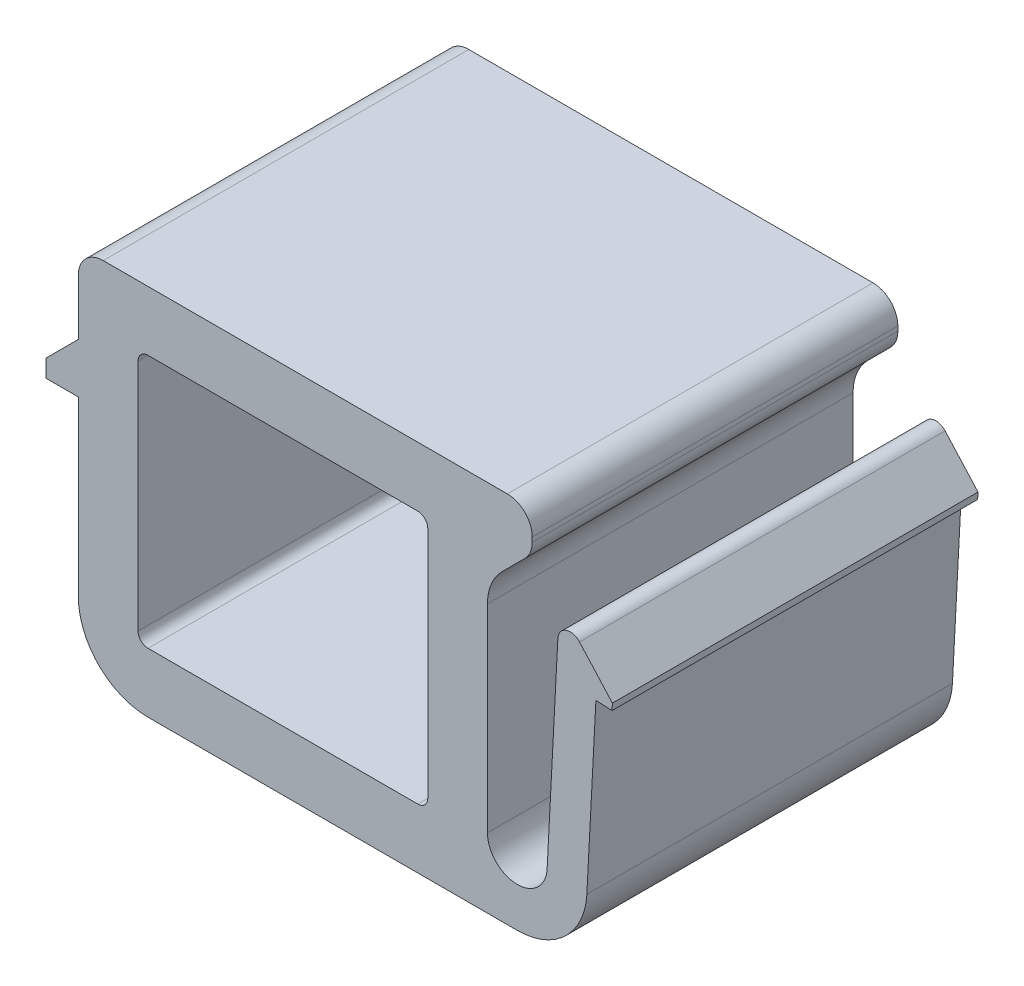
ISO-10303-21;
HEADER;
FILE_DESCRIPTION(('STEP AP214'),'2;1');
FILE_NAME('part.step','',(''),(''),'','','');
FILE_SCHEMA(('AUTOMOTIVE_DESIGN { 1 0 10303 214 1 1 1 1 }'));
ENDSEC;
DATA;
#1=APPLICATION_CONTEXT('core data for automotive mechanical design processes');
#2=APPLICATION_PROTOCOL_DEFINITION('international standard','automotive_design',2000,#1);
#3=PRODUCT_CONTEXT('',#1,'mechanical');
#4=PRODUCT('Part','Part','',(#3));
#5=PRODUCT_RELATED_PRODUCT_CATEGORY('part','',(#4));
#6=PRODUCT_DEFINITION_FORMATION('','',#4);
#7=PRODUCT_DEFINITION_CONTEXT('part definition',#1,'design');
#8=PRODUCT_DEFINITION('design','',#6,#7);
#9=PRODUCT_DEFINITION_SHAPE('','',#8);
#10=(LENGTH_UNIT() NAMED_UNIT(*) SI_UNIT(.MILLI.,.METRE.));
#11=(NAMED_UNIT(*) PLANE_ANGLE_UNIT() SI_UNIT($,.RADIAN.));
#12=(NAMED_UNIT(*) SI_UNIT($,.STERADIAN.) SOLID_ANGLE_UNIT());
#13=UNCERTAINTY_MEASURE_WITH_UNIT(LENGTH_MEASURE(1.E-05),#10,'distance_accuracy_value','');
#14=(GEOMETRIC_REPRESENTATION_CONTEXT(3) GLOBAL_UNCERTAINTY_ASSIGNED_CONTEXT((#13)) GLOBAL_UNIT_ASSIGNED_CONTEXT((#10,
#11,#12)) REPRESENTATION_CONTEXT('',''));
#15=CARTESIAN_POINT('',(0.,0.,0.));
#16=DIRECTION('',(0.,0.,1.));
#17=DIRECTION('',(1.,0.,0.));
#18=AXIS2_PLACEMENT_3D('',#15,#16,#17);
#19=CARTESIAN_POINT('',(180.349494064628,355.600068402604,-115.321000953769));
#20=DIRECTION('',(0.707106781186545,-0.70710678118655,0.));
#21=DIRECTION('',(0.70710678118655,0.707106781186545,0.));
#22=AXIS2_PLACEMENT_3D('',#19,#20,#21);
#23=PLANE('',#22);
#24=DIRECTION('',(0.,0.,1.));
#25=VECTOR('',#24,1.);
#26=CARTESIAN_POINT('',(181.856600845815,357.107175183791,-115.321000953769));
#27=LINE('',#26,#25);
#28=CARTESIAN_POINT('',(181.856600845815,357.107175183791,-100.621000953769));
#29=VERTEX_POINT('',#28);
#30=CARTESIAN_POINT('',(181.856600845815,357.107175183791,-115.321000953769));
#31=VERTEX_POINT('',#30);
#32=EDGE_CURVE('E191',#29,#31,#27,.F.);
#33=ORIENTED_EDGE('',*,*,#32,.F.);
#34=DIRECTION('',(0.70710678118655,0.707106781186545,0.));
#35=VECTOR('',#34,1.);
#36=CARTESIAN_POINT('',(180.349494064628,355.600068402604,-100.621000953769));
#37=LINE('',#36,#35);
#38=CARTESIAN_POINT('',(180.935280502256,356.185854840232,-100.621000953769));
#39=VERTEX_POINT('',#38);
#40=EDGE_CURVE('E187',#29,#39,#37,.F.);
#41=ORIENTED_EDGE('',*,*,#40,.T.);
#42=DIRECTION('',(0.,0.,1.));
#43=VECTOR('',#42,1.);
#44=CARTESIAN_POINT('',(180.935280502256,356.185854840232,-115.421000953769));
#45=LINE('',#44,#43);
#46=CARTESIAN_POINT('',(180.935280502256,356.185854840232,-115.321000953769));
#47=VERTEX_POINT('',#46);
#48=EDGE_CURVE('E367',#39,#47,#45,.F.);
#49=ORIENTED_EDGE('',*,*,#48,.T.);
#50=DIRECTION('',(0.70710678118655,0.707106781186545,0.));
#51=VECTOR('',#50,1.);
#52=CARTESIAN_POINT('',(180.349494064628,355.600068402604,-115.321000953769));
#53=LINE('',#52,#51);
#54=EDGE_CURVE('E372',#47,#31,#53,.T.);
#55=ORIENTED_EDGE('',*,*,#54,.T.);
#56=EDGE_LOOP('',(#33,#41,#49,#55));
#57=FACE_BOUND('',#56,.T.);
#58=ADVANCED_FACE('F17',(#57),#23,.T.);
#59=CARTESIAN_POINT('',(181.149494064629,357.814281964978,-115.321000953769));
#60=DIRECTION('',(0.,0.,1.));
#61=DIRECTION('',(0.,-1.,0.));
#62=AXIS2_PLACEMENT_3D('',#59,#60,#61);
#63=CYLINDRICAL_SURFACE('',#62,1.);
#64=CARTESIAN_POINT('',(181.149494064629,357.814281964978,-115.321000953769));
#65=DIRECTION('',(0.,0.,1.));
#66=DIRECTION('',(0.,-1.,0.));
#67=AXIS2_PLACEMENT_3D('',#64,#65,#66);
#68=CIRCLE('',#67,1.);
#69=CARTESIAN_POINT('',(182.149494064629,357.814281964978,-115.321000953769));
#70=VERTEX_POINT('',#69);
#71=EDGE_CURVE('E196',#31,#70,#68,.T.);
#72=ORIENTED_EDGE('',*,*,#71,.T.);
#73=DIRECTION('',(0.,0.,1.));
#74=VECTOR('',#73,1.);
#75=CARTESIAN_POINT('',(182.149494064629,357.814281964978,-115.321000953769));
#76=LINE('',#75,#74);
#77=CARTESIAN_POINT('',(182.149494064629,357.814281964978,-100.621000953769));
#78=VERTEX_POINT('',#77);
#79=EDGE_CURVE('E193',#78,#70,#76,.F.);
#80=ORIENTED_EDGE('',*,*,#79,.F.);
#81=CARTESIAN_POINT('',(181.149494064629,357.814281964978,-100.621000953769));
#82=DIRECTION('',(0.,0.,1.));
#83=DIRECTION('',(0.,-1.,0.));
#84=AXIS2_PLACEMENT_3D('',#81,#82,#83);
#85=CIRCLE('',#84,1.);
#86=EDGE_CURVE('E20',#78,#29,#85,.F.);
#87=ORIENTED_EDGE('',*,*,#86,.T.);
#88=ORIENTED_EDGE('',*,*,#32,.T.);
#89=EDGE_LOOP('',(#72,#80,#87,#88));
#90=FACE_BOUND('',#89,.T.);
#91=ADVANCED_FACE('F194',(#90),#63,.T.);
#92=CARTESIAN_POINT('',(162.599494064628,355.185854578278,-115.521000953769));
#93=DIRECTION('',(-1.,0.,0.));
#94=DIRECTION('',(0.,-1.,0.));
#95=AXIS2_PLACEMENT_3D('',#92,#93,#94);
#96=PLANE('',#95);
#97=DIRECTION('',(0.,-1.,0.));
#98=VECTOR('',#97,1.);
#99=CARTESIAN_POINT('',(162.599494064628,355.185854578278,-100.621000953769));
#100=LINE('',#99,#98);
#101=CARTESIAN_POINT('',(162.599494064628,353.750068140651,-100.621000953769));
#102=VERTEX_POINT('',#101);
#103=CARTESIAN_POINT('',(162.599494064628,354.454483728379,-100.621000953769));
#104=VERTEX_POINT('',#103);
#105=EDGE_CURVE('E364',#102,#104,#100,.F.);
#106=ORIENTED_EDGE('',*,*,#105,.T.);
#107=DIRECTION('',(0.,0.,1.));
#108=VECTOR('',#107,1.);
#109=CARTESIAN_POINT('',(162.599494064628,354.45448372838,-115.521000953769));
#110=LINE('',#109,#108);
#111=CARTESIAN_POINT('',(162.599494064628,354.45448372838,-115.321000953769));
#112=VERTEX_POINT('',#111);
#113=EDGE_CURVE('E320',#112,#104,#110,.T.);
#114=ORIENTED_EDGE('',*,*,#113,.F.);
#115=DIRECTION('',(0.,-1.,0.));
#116=VECTOR('',#115,1.);
#117=CARTESIAN_POINT('',(162.599494064628,355.185854578278,-115.321000953769));
#118=LINE('',#117,#116);
#119=CARTESIAN_POINT('',(162.599494064628,353.750068140651,-115.321000953769));
#120=VERTEX_POINT('',#119);
#121=EDGE_CURVE('E386',#112,#120,#118,.T.);
#122=ORIENTED_EDGE('',*,*,#121,.T.);
#123=DIRECTION('',(0.,0.,1.));
#124=VECTOR('',#123,1.);
#125=CARTESIAN_POINT('',(162.599494064628,353.750068140651,-115.521000953769));
#126=LINE('',#125,#124);
#127=EDGE_CURVE('E349',#102,#120,#126,.F.);
#128=ORIENTED_EDGE('',*,*,#127,.F.);
#129=EDGE_LOOP('',(#106,#114,#122,#128));
#130=FACE_BOUND('',#129,.T.);
#131=ADVANCED_FACE('F630',(#130),#96,.T.);
#132=CARTESIAN_POINT('',(162.199494064628,353.750068140651,-115.521000953769));
#133=DIRECTION('',(0.,-1.,0.));
#134=DIRECTION('',(1.,0.,0.));
#135=AXIS2_PLACEMENT_3D('',#132,#133,#134);
#136=PLANE('',#135);
#137=DIRECTION('',(1.,0.,0.));
#138=VECTOR('',#137,1.);
#139=CARTESIAN_POINT('',(162.199494064628,353.750068140651,-100.621000953769));
#140=LINE('',#139,#138);
#141=CARTESIAN_POINT('',(163.89949406463,353.750068140651,-100.621000953769));
#142=VERTEX_POINT('',#141);
#143=EDGE_CURVE('E356',#142,#102,#140,.F.);
#144=ORIENTED_EDGE('',*,*,#143,.T.);
#145=ORIENTED_EDGE('',*,*,#127,.T.);
#146=DIRECTION('',(1.,0.,0.));
#147=VECTOR('',#146,1.);
#148=CARTESIAN_POINT('',(162.199494064628,353.750068140651,-115.321000953769));
#149=LINE('',#148,#147);
#150=CARTESIAN_POINT('',(163.89949406463,353.750068140651,-115.321000953769));
#151=VERTEX_POINT('',#150);
#152=EDGE_CURVE('E359',#120,#151,#149,.T.);
#153=ORIENTED_EDGE('',*,*,#152,.T.);
#154=DIRECTION('',(0.,0.,1.));
#155=VECTOR('',#154,1.);
#156=CARTESIAN_POINT('',(163.89949406463,353.750068140651,-115.521000953769));
#157=LINE('',#156,#155);
#158=EDGE_CURVE('E312',#142,#151,#157,.F.);
#159=ORIENTED_EDGE('',*,*,#158,.F.);
#160=EDGE_LOOP('',(#144,#145,#153,#159));
#161=FACE_BOUND('',#160,.T.);
#162=ADVANCED_FACE('F594',(#161),#136,.T.);
#163=CARTESIAN_POINT('',(184.709391644121,353.594002730076,-115.521000953769));
#164=DIRECTION('',(-0.0523359562437548,-0.998629534754531,0.));
#165=DIRECTION('',(0.998629534754531,-0.0523359562437548,0.));
#166=AXIS2_PLACEMENT_3D('',#163,#164,#165);
#167=PLANE('',#166);
#168=DIRECTION('',(0.998629534754531,-0.0523359562437548,0.));
#169=VECTOR('',#168,1.);
#170=CARTESIAN_POINT('',(184.709391644121,353.594002730076,-100.621000953769));
#171=LINE('',#170,#169);
#172=CARTESIAN_POINT('',(185.35850084171,353.559984358517,-100.621000953769));
#173=VERTEX_POINT('',#172);
#174=CARTESIAN_POINT('',(184.709391644121,353.594002730076,-100.621000953769));
#175=VERTEX_POINT('',#174);
#176=EDGE_CURVE('E343',#173,#175,#171,.F.);
#177=ORIENTED_EDGE('',*,*,#176,.T.);
#178=DIRECTION('',(0.,0.,1.));
#179=VECTOR('',#178,1.);
#180=CARTESIAN_POINT('',(184.709391644121,353.594002730076,-115.521000953769));
#181=LINE('',#180,#179);
#182=CARTESIAN_POINT('',(184.709391644121,353.594002730076,-115.321000953769));
#183=VERTEX_POINT('',#182);
#184=EDGE_CURVE('E291',#183,#175,#181,.T.);
#185=ORIENTED_EDGE('',*,*,#184,.F.);
#186=DIRECTION('',(0.998629534754531,-0.0523359562437548,0.));
#187=VECTOR('',#186,1.);
#188=CARTESIAN_POINT('',(184.709391644121,353.594002730076,-115.321000953769));
#189=LINE('',#188,#187);
#190=CARTESIAN_POINT('',(185.35850084171,353.559984358517,-115.321000953769));
#191=VERTEX_POINT('',#190);
#192=EDGE_CURVE('E346',#183,#191,#189,.T.);
#193=ORIENTED_EDGE('',*,*,#192,.T.);
#194=DIRECTION('',(0.,0.,1.));
#195=VECTOR('',#194,1.);
#196=CARTESIAN_POINT('',(185.35850084171,353.559984358517,-115.521000953769));
#197=LINE('',#196,#195);
#198=EDGE_CURVE('E337',#173,#191,#197,.F.);
#199=ORIENTED_EDGE('',*,*,#198,.F.);
#200=EDGE_LOOP('',(#177,#185,#193,#199));
#201=FACE_BOUND('',#200,.T.);
#202=ADVANCED_FACE('F618',(#201),#167,.T.);
#203=CARTESIAN_POINT('',(185.35850084171,353.559984358517,-115.521000953769));
#204=DIRECTION('',(0.99862953475458,-0.0523359562428256,0.));
#205=DIRECTION('',(0.0523359562428256,0.99862953475458,0.));
#206=AXIS2_PLACEMENT_3D('',#203,#204,#205);
#207=PLANE('',#206);
#208=DIRECTION('',(0.0523359562428256,0.99862953475458,0.));
#209=VECTOR('',#208,1.);
#210=CARTESIAN_POINT('',(185.35850084171,353.559984358517,-100.621000953769));
#211=LINE('',#210,#209);
#212=CARTESIAN_POINT('',(185.372484947691,353.826816996197,-100.621000953769));
#213=VERTEX_POINT('',#212);
#214=EDGE_CURVE('E334',#213,#173,#211,.F.);
#215=ORIENTED_EDGE('',*,*,#214,.T.);
#216=ORIENTED_EDGE('',*,*,#198,.T.);
#217=DIRECTION('',(0.0523359562428256,0.99862953475458,0.));
#218=VECTOR('',#217,1.);
#219=CARTESIAN_POINT('',(185.35850084171,353.559984358517,-115.321000953769));
#220=LINE('',#219,#218);
#221=CARTESIAN_POINT('',(185.372484947691,353.826816996197,-115.321000953769));
#222=VERTEX_POINT('',#221);
#223=EDGE_CURVE('E338',#191,#222,#220,.T.);
#224=ORIENTED_EDGE('',*,*,#223,.T.);
#225=DIRECTION('',(0.,0.,1.));
#226=VECTOR('',#225,1.);
#227=CARTESIAN_POINT('',(185.372484947691,353.826816996197,-115.521000953769));
#228=LINE('',#227,#226);
#229=EDGE_CURVE('E287',#213,#222,#228,.F.);
#230=ORIENTED_EDGE('',*,*,#229,.F.);
#231=EDGE_LOOP('',(#215,#216,#224,#230));
#232=FACE_BOUND('',#231,.T.);
#233=ADVANCED_FACE('F459',(#232),#207,.T.);
#234=CARTESIAN_POINT('',(183.67946407574,354.959868889521,-115.421000953769));
#235=DIRECTION('',(0.,0.,1.));
#236=DIRECTION('',(0.,-1.,0.));
#237=AXIS2_PLACEMENT_3D('',#234,#235,#236);
#238=CYLINDRICAL_SURFACE('',#237,0.499999999999997);
#239=CARTESIAN_POINT('',(183.67946407574,354.959868889521,-115.321000953769));
#240=DIRECTION('',(0.,0.,1.));
#241=DIRECTION('',(0.,-1.,0.));
#242=AXIS2_PLACEMENT_3D('',#239,#240,#241);
#243=CIRCLE('',#242,0.499999999999997);
#244=CARTESIAN_POINT('',(184.051036488479,355.2944341927,-115.321000953769));
#245=VERTEX_POINT('',#244);
#246=CARTESIAN_POINT('',(183.180149308363,354.986036867642,-115.321000953769));
#247=VERTEX_POINT('',#246);
#248=EDGE_CURVE('E440',#245,#247,#243,.T.);
#249=ORIENTED_EDGE('',*,*,#248,.T.);
#250=DIRECTION('',(0.,0.,1.));
#251=VECTOR('',#250,1.);
#252=CARTESIAN_POINT('',(183.180149308363,354.986036867642,-115.321000953769));
#253=LINE('',#252,#251);
#254=CARTESIAN_POINT('',(183.180149308363,354.986036867642,-100.621000953769));
#255=VERTEX_POINT('',#254);
#256=EDGE_CURVE('E284',#247,#255,#253,.T.);
#257=ORIENTED_EDGE('',*,*,#256,.T.);
#258=CARTESIAN_POINT('',(183.67946407574,354.959868889521,-100.621000953769));
#259=DIRECTION('',(0.,0.,1.));
#260=DIRECTION('',(0.,-1.,0.));
#261=AXIS2_PLACEMENT_3D('',#258,#259,#260);
#262=CIRCLE('',#261,0.499999999999997);
#263=CARTESIAN_POINT('',(184.051036488479,355.2944341927,-100.621000953769));
#264=VERTEX_POINT('',#263);
#265=EDGE_CURVE('E377',#255,#264,#262,.F.);
#266=ORIENTED_EDGE('',*,*,#265,.T.);
#267=DIRECTION('',(0.,0.,1.));
#268=VECTOR('',#267,1.);
#269=CARTESIAN_POINT('',(184.051036488479,355.2944341927,-115.521000953769));
#270=LINE('',#269,#268);
#271=EDGE_CURVE('E288',#245,#264,#270,.T.);
#272=ORIENTED_EDGE('',*,*,#271,.F.);
#273=EDGE_LOOP('',(#249,#257,#266,#272));
#274=FACE_BOUND('',#273,.T.);
#275=ADVANCED_FACE('F444',(#274),#238,.T.);
#276=CARTESIAN_POINT('',(182.349494064629,354.771641277859,-115.421000953769));
#277=DIRECTION('',(0.,0.,1.));
#278=DIRECTION('',(0.,-1.,0.));
#279=AXIS2_PLACEMENT_3D('',#276,#277,#278);
#280=CYLINDRICAL_SURFACE('',#279,2.);
#281=ORIENTED_EDGE('',*,*,#48,.F.);
#282=CARTESIAN_POINT('',(182.349494064629,354.771641277859,-100.621000953769));
#283=DIRECTION('',(0.,0.,1.));
#284=DIRECTION('',(0.,-1.,0.));
#285=AXIS2_PLACEMENT_3D('',#282,#283,#284);
#286=CIRCLE('',#285,2.);
#287=CARTESIAN_POINT('',(180.349494064628,354.771641277858,-100.621000953769));
#288=VERTEX_POINT('',#287);
#289=EDGE_CURVE('E371',#288,#39,#286,.F.);
#290=ORIENTED_EDGE('',*,*,#289,.F.);
#291=DIRECTION('',(0.,0.,1.));
#292=VECTOR('',#291,1.);
#293=CARTESIAN_POINT('',(180.349494064629,354.771641277858,-115.521000953769));
#294=LINE('',#293,#292);
#295=CARTESIAN_POINT('',(180.349494064628,354.771641277859,-115.321000953769));
#296=VERTEX_POINT('',#295);
#297=EDGE_CURVE('E279',#296,#288,#294,.T.);
#298=ORIENTED_EDGE('',*,*,#297,.F.);
#299=CARTESIAN_POINT('',(182.349494064629,354.771641277859,-115.321000953769));
#300=DIRECTION('',(0.,0.,1.));
#301=DIRECTION('',(0.,-1.,0.));
#302=AXIS2_PLACEMENT_3D('',#299,#300,#301);
#303=CIRCLE('',#302,2.);
#304=EDGE_CURVE('E370',#47,#296,#303,.T.);
#305=ORIENTED_EDGE('',*,*,#304,.F.);
#306=EDGE_LOOP('',(#281,#290,#298,#305));
#307=FACE_BOUND('',#306,.T.);
#308=ADVANCED_FACE('F552',(#307),#280,.F.);
#309=CARTESIAN_POINT('',(177.549494064629,356.200068402603,-115.321000953769));
#310=DIRECTION('',(0.,0.,1.));
#311=DIRECTION('',(0.,-1.,0.));
#312=AXIS2_PLACEMENT_3D('',#309,#310,#311);
#313=CYLINDRICAL_SURFACE('',#312,0.4);
#314=DIRECTION('',(0.,0.,1.));
#315=VECTOR('',#314,1.);
#316=CARTESIAN_POINT('',(177.949494064629,356.200068402603,-115.321000953769));
#317=LINE('',#316,#315);
#318=CARTESIAN_POINT('',(177.949494064629,356.200068402603,-115.321000953769));
#319=VERTEX_POINT('',#318);
#320=CARTESIAN_POINT('',(177.949494064629,356.200068402603,-100.621000953769));
#321=VERTEX_POINT('',#320);
#322=EDGE_CURVE('E260',#319,#321,#317,.T.);
#323=ORIENTED_EDGE('',*,*,#322,.T.);
#324=CARTESIAN_POINT('',(177.549494064629,356.200068402603,-100.621000953769));
#325=DIRECTION('',(0.,0.,1.));
#326=DIRECTION('',(0.,-1.,0.));
#327=AXIS2_PLACEMENT_3D('',#324,#325,#326);
#328=CIRCLE('',#327,0.4);
#329=CARTESIAN_POINT('',(177.549494064628,356.600068402601,-100.621000953769));
#330=VERTEX_POINT('',#329);
#331=EDGE_CURVE('E436',#330,#321,#328,.F.);
#332=ORIENTED_EDGE('',*,*,#331,.F.);
#333=DIRECTION('',(0.,0.,1.));
#334=VECTOR('',#333,1.);
#335=CARTESIAN_POINT('',(177.549494064628,356.600068402603,-115.321000953769));
#336=LINE('',#335,#334);
#337=CARTESIAN_POINT('',(177.549494064629,356.600068402602,-115.321000953769));
#338=VERTEX_POINT('',#337);
#339=EDGE_CURVE('E269',#330,#338,#336,.F.);
#340=ORIENTED_EDGE('',*,*,#339,.T.);
#341=CARTESIAN_POINT('',(177.549494064629,356.200068402603,-115.321000953769));
#342=DIRECTION('',(0.,0.,1.));
#343=DIRECTION('',(0.,-1.,0.));
#344=AXIS2_PLACEMENT_3D('',#341,#342,#343);
#345=CIRCLE('',#344,0.4);
#346=EDGE_CURVE('E434',#319,#338,#345,.T.);
#347=ORIENTED_EDGE('',*,*,#346,.F.);
#348=EDGE_LOOP('',(#323,#332,#340,#347));
#349=FACE_BOUND('',#348,.T.);
#350=ADVANCED_FACE('F508',(#349),#313,.F.);
#351=CARTESIAN_POINT('',(177.549494064632,346.800068402603,-115.321000953769));
#352=DIRECTION('',(0.,0.,1.));
#353=DIRECTION('',(0.,-1.,0.));
#354=AXIS2_PLACEMENT_3D('',#351,#352,#353);
#355=CYLINDRICAL_SURFACE('',#354,0.4);
#356=DIRECTION('',(0.,0.,1.));
#357=VECTOR('',#356,1.);
#358=CARTESIAN_POINT('',(177.549494064632,346.400068402604,-115.321000953769));
#359=LINE('',#358,#357);
#360=CARTESIAN_POINT('',(177.549494064632,346.400068402603,-115.321000953769));
#361=VERTEX_POINT('',#360);
#362=CARTESIAN_POINT('',(177.549494064632,346.400068402603,-100.621000953769));
#363=VERTEX_POINT('',#362);
#364=EDGE_CURVE('E251',#361,#363,#359,.T.);
#365=ORIENTED_EDGE('',*,*,#364,.T.);
#366=CARTESIAN_POINT('',(177.549494064632,346.800068402603,-100.621000953769));
#367=DIRECTION('',(0.,0.,1.));
#368=DIRECTION('',(0.,-1.,0.));
#369=AXIS2_PLACEMENT_3D('',#366,#367,#368);
#370=CIRCLE('',#369,0.4);
#371=CARTESIAN_POINT('',(177.94949406463,346.800068402603,-100.621000953769));
#372=VERTEX_POINT('',#371);
#373=EDGE_CURVE('E432',#372,#363,#370,.F.);
#374=ORIENTED_EDGE('',*,*,#373,.F.);
#375=DIRECTION('',(0.,0.,1.));
#376=VECTOR('',#375,1.);
#377=CARTESIAN_POINT('',(177.949494064632,346.800068402604,-115.321000953769));
#378=LINE('',#377,#376);
#379=CARTESIAN_POINT('',(177.94949406463,346.800068402603,-115.321000953769));
#380=VERTEX_POINT('',#379);
#381=EDGE_CURVE('E263',#372,#380,#378,.F.);
#382=ORIENTED_EDGE('',*,*,#381,.T.);
#383=CARTESIAN_POINT('',(177.549494064632,346.800068402603,-115.321000953769));
#384=DIRECTION('',(0.,0.,1.));
#385=DIRECTION('',(0.,-1.,0.));
#386=AXIS2_PLACEMENT_3D('',#383,#384,#385);
#387=CIRCLE('',#386,0.4);
#388=EDGE_CURVE('E430',#361,#380,#387,.T.);
#389=ORIENTED_EDGE('',*,*,#388,.F.);
#390=EDGE_LOOP('',(#365,#374,#382,#389));
#391=FACE_BOUND('',#390,.T.);
#392=ADVANCED_FACE('F519',(#391),#355,.F.);
#393=CARTESIAN_POINT('',(166.699483864038,346.800068402601,-115.321000953769));
#394=DIRECTION('',(0.,0.,-1.));
#395=DIRECTION('',(0.,1.,0.));
#396=AXIS2_PLACEMENT_3D('',#393,#394,#395);
#397=CYLINDRICAL_SURFACE('',#396,0.399999999999991);
#398=DIRECTION('',(0.,0.,1.));
#399=VECTOR('',#398,1.);
#400=CARTESIAN_POINT('',(166.699483864038,346.400068402601,-115.321000953769));
#401=LINE('',#400,#399);
#402=CARTESIAN_POINT('',(166.699483864038,346.400068402602,-100.621000953769));
#403=VERTEX_POINT('',#402);
#404=CARTESIAN_POINT('',(166.699483864038,346.400068402602,-115.321000953769));
#405=VERTEX_POINT('',#404);
#406=EDGE_CURVE('E257',#403,#405,#401,.F.);
#407=ORIENTED_EDGE('',*,*,#406,.T.);
#408=CARTESIAN_POINT('',(166.699483864038,346.800068402601,-115.321000953769));
#409=DIRECTION('',(0.,0.,-1.));
#410=DIRECTION('',(0.,1.,0.));
#411=AXIS2_PLACEMENT_3D('',#408,#409,#410);
#412=CIRCLE('',#411,0.399999999999991);
#413=CARTESIAN_POINT('',(166.299483864038,346.800068402601,-115.321000953769));
#414=VERTEX_POINT('',#413);
#415=EDGE_CURVE('E428',#414,#405,#412,.F.);
#416=ORIENTED_EDGE('',*,*,#415,.F.);
#417=DIRECTION('',(0.,0.,1.));
#418=VECTOR('',#417,1.);
#419=CARTESIAN_POINT('',(166.299483864038,346.8000684026,-115.321000953769));
#420=LINE('',#419,#418);
#421=CARTESIAN_POINT('',(166.299483864038,346.8000684026,-100.621000953769));
#422=VERTEX_POINT('',#421);
#423=EDGE_CURVE('E247',#414,#422,#420,.T.);
#424=ORIENTED_EDGE('',*,*,#423,.T.);
#425=CARTESIAN_POINT('',(166.699483864038,346.800068402601,-100.621000953769));
#426=DIRECTION('',(0.,0.,-1.));
#427=DIRECTION('',(0.,1.,0.));
#428=AXIS2_PLACEMENT_3D('',#425,#426,#427);
#429=CIRCLE('',#428,0.399999999999991);
#430=EDGE_CURVE('E426',#403,#422,#429,.T.);
#431=ORIENTED_EDGE('',*,*,#430,.F.);
#432=EDGE_LOOP('',(#407,#416,#424,#431));
#433=FACE_BOUND('',#432,.T.);
#434=ADVANCED_FACE('F527',(#433),#397,.F.);
#435=CARTESIAN_POINT('',(166.699483864035,356.200068402601,-115.321000953769));
#436=DIRECTION('',(0.,0.,1.));
#437=DIRECTION('',(0.,-1.,0.));
#438=AXIS2_PLACEMENT_3D('',#435,#436,#437);
#439=CYLINDRICAL_SURFACE('',#438,0.4);
#440=DIRECTION('',(0.,0.,1.));
#441=VECTOR('',#440,1.);
#442=CARTESIAN_POINT('',(166.699483864035,356.6000684026,-115.321000953769));
#443=LINE('',#442,#441);
#444=CARTESIAN_POINT('',(166.699483864035,356.600068402601,-115.321000953769));
#445=VERTEX_POINT('',#444);
#446=CARTESIAN_POINT('',(166.699483864035,356.6000684026,-100.621000953769));
#447=VERTEX_POINT('',#446);
#448=EDGE_CURVE('E266',#445,#447,#443,.T.);
#449=ORIENTED_EDGE('',*,*,#448,.T.);
#450=CARTESIAN_POINT('',(166.699483864035,356.200068402601,-100.621000953769));
#451=DIRECTION('',(0.,0.,1.));
#452=DIRECTION('',(0.,-1.,0.));
#453=AXIS2_PLACEMENT_3D('',#450,#451,#452);
#454=CIRCLE('',#453,0.4);
#455=CARTESIAN_POINT('',(166.299483864037,356.2000684026,-100.621000953769));
#456=VERTEX_POINT('',#455);
#457=EDGE_CURVE('E424',#456,#447,#454,.F.);
#458=ORIENTED_EDGE('',*,*,#457,.F.);
#459=DIRECTION('',(0.,0.,1.));
#460=VECTOR('',#459,1.);
#461=CARTESIAN_POINT('',(166.299483864035,356.2000684026,-115.321000953769));
#462=LINE('',#461,#460);
#463=CARTESIAN_POINT('',(166.299483864037,356.2000684026,-115.321000953769));
#464=VERTEX_POINT('',#463);
#465=EDGE_CURVE('E250',#456,#464,#462,.F.);
#466=ORIENTED_EDGE('',*,*,#465,.T.);
#467=CARTESIAN_POINT('',(166.699483864035,356.200068402601,-115.321000953769));
#468=DIRECTION('',(0.,0.,1.));
#469=DIRECTION('',(0.,-1.,0.));
#470=AXIS2_PLACEMENT_3D('',#467,#468,#469);
#471=CIRCLE('',#470,0.4);
#472=EDGE_CURVE('E201',#445,#464,#471,.T.);
#473=ORIENTED_EDGE('',*,*,#472,.F.);
#474=EDGE_LOOP('',(#449,#458,#466,#473));
#475=FACE_BOUND('',#474,.T.);
#476=ADVANCED_FACE('F536',(#475),#439,.F.);
#477=CARTESIAN_POINT('',(182.149494064629,357.400068402605,-115.321000953769));
#478=DIRECTION('',(1.,2.55351295663791E-13,0.));
#479=DIRECTION('',(-2.55351295663791E-13,1.,0.));
#480=AXIS2_PLACEMENT_3D('',#477,#478,#479);
#481=PLANE('',#480);
#482=ORIENTED_EDGE('',*,*,#79,.T.);
#483=DIRECTION('',(-2.55351295663791E-13,1.,0.));
#484=VECTOR('',#483,1.);
#485=CARTESIAN_POINT('',(182.149494064629,357.400068402605,-115.321000953769));
#486=LINE('',#485,#484);
#487=CARTESIAN_POINT('',(182.149494064629,358.000084151732,-115.321000953769));
#488=VERTEX_POINT('',#487);
#489=EDGE_CURVE('E200',#70,#488,#486,.T.);
#490=ORIENTED_EDGE('',*,*,#489,.T.);
#491=DIRECTION('',(0.,0.,-1.));
#492=VECTOR('',#491,1.);
#493=CARTESIAN_POINT('',(182.149494064629,358.000084151732,-115.421000953769));
#494=LINE('',#493,#492);
#495=CARTESIAN_POINT('',(182.149494064629,358.000084151732,-100.621000953769));
#496=VERTEX_POINT('',#495);
#497=EDGE_CURVE('E204',#496,#488,#494,.T.);
#498=ORIENTED_EDGE('',*,*,#497,.F.);
#499=DIRECTION('',(0.,-1.,0.));
#500=VECTOR('',#499,1.);
#501=CARTESIAN_POINT('',(182.149494064629,355.89374901585,-100.621000953769));
#502=LINE('',#501,#500);
#503=EDGE_CURVE('E184',#78,#496,#502,.F.);
#504=ORIENTED_EDGE('',*,*,#503,.F.);
#505=EDGE_LOOP('',(#482,#490,#498,#504));
#506=FACE_BOUND('',#505,.T.);
#507=ADVANCED_FACE('F203',(#506),#481,.T.);
#508=CARTESIAN_POINT('',(163.899494064628,359.0000684026,-115.521000953769));
#509=DIRECTION('',(-1.,-2.53303195599943E-13,0.));
#510=DIRECTION('',(2.53303195599943E-13,-1.,0.));
#511=AXIS2_PLACEMENT_3D('',#508,#509,#510);
#512=PLANE('',#511);
#513=DIRECTION('',(0.,0.,1.));
#514=VECTOR('',#513,1.);
#515=CARTESIAN_POINT('',(163.899494064629,355.754483728381,-115.521000953769));
#516=LINE('',#515,#514);
#517=CARTESIAN_POINT('',(163.899494064628,355.75448372838,-100.621000953769));
#518=VERTEX_POINT('',#517);
#519=CARTESIAN_POINT('',(163.899494064628,355.75448372838,-115.321000953769));
#520=VERTEX_POINT('',#519);
#521=EDGE_CURVE('E315',#518,#520,#516,.F.);
#522=ORIENTED_EDGE('',*,*,#521,.F.);
#523=DIRECTION('',(0.,-1.,0.));
#524=VECTOR('',#523,1.);
#525=CARTESIAN_POINT('',(163.899494064628,355.89374901585,-100.621000953769));
#526=LINE('',#525,#524);
#527=CARTESIAN_POINT('',(163.899494064628,358.000084151727,-100.621000953769));
#528=VERTEX_POINT('',#527);
#529=EDGE_CURVE('E241',#528,#518,#526,.T.);
#530=ORIENTED_EDGE('',*,*,#529,.F.);
#531=DIRECTION('',(0.,0.,1.));
#532=VECTOR('',#531,1.);
#533=CARTESIAN_POINT('',(163.899494064628,358.000084151727,-115.521000953769));
#534=LINE('',#533,#532);
#535=CARTESIAN_POINT('',(163.899494064628,358.000084151727,-115.321000953769));
#536=VERTEX_POINT('',#535);
#537=EDGE_CURVE('E254',#536,#528,#534,.T.);
#538=ORIENTED_EDGE('',*,*,#537,.F.);
#539=DIRECTION('',(0.,-1.,0.));
#540=VECTOR('',#539,1.);
#541=CARTESIAN_POINT('',(163.899494064628,355.89374901585,-115.321000953769));
#542=LINE('',#541,#540);
#543=EDGE_CURVE('E275',#536,#520,#542,.T.);
#544=ORIENTED_EDGE('',*,*,#543,.T.);
#545=EDGE_LOOP('',(#522,#530,#538,#544));
#546=FACE_BOUND('',#545,.T.);
#547=ADVANCED_FACE('F570',(#546),#512,.T.);
#548=CARTESIAN_POINT('',(164.265179489578,356.12016915333,-115.521000953769));
#549=DIRECTION('',(-0.707106781186548,0.707106781186548,0.));
#550=DIRECTION('',(-0.707106781186548,-0.707106781186548,0.));
#551=AXIS2_PLACEMENT_3D('',#548,#549,#550);
#552=PLANE('',#551);
#553=DIRECTION('',(-0.70710678118654,-0.707106781186555,0.));
#554=VECTOR('',#553,1.);
#555=CARTESIAN_POINT('',(163.899494064629,355.75448372838,-100.621000953769));
#556=LINE('',#555,#554);
#557=EDGE_CURVE('E238',#518,#104,#556,.T.);
#558=ORIENTED_EDGE('',*,*,#557,.F.);
#559=ORIENTED_EDGE('',*,*,#521,.T.);
#560=DIRECTION('',(-0.707106781186555,-0.70710678118654,0.));
#561=VECTOR('',#560,1.);
#562=CARTESIAN_POINT('',(163.899494064629,355.754483728381,-115.321000953769));
#563=LINE('',#562,#561);
#564=EDGE_CURVE('E323',#520,#112,#563,.T.);
#565=ORIENTED_EDGE('',*,*,#564,.T.);
#566=ORIENTED_EDGE('',*,*,#113,.T.);
#567=EDGE_LOOP('',(#558,#559,#565,#566));
#568=FACE_BOUND('',#567,.T.);
#569=ADVANCED_FACE('F576',(#568),#552,.T.);
#570=CARTESIAN_POINT('',(163.89949406463,353.750068140651,-115.521000953769));
#571=DIRECTION('',(-1.,-2.94367748877281E-13,0.));
#572=DIRECTION('',(2.94367748877281E-13,-1.,0.));
#573=AXIS2_PLACEMENT_3D('',#570,#571,#572);
#574=PLANE('',#573);
#575=ORIENTED_EDGE('',*,*,#158,.T.);
#576=DIRECTION('',(0.,-1.,0.));
#577=VECTOR('',#576,1.);
#578=CARTESIAN_POINT('',(163.89949406463,355.89374901585,-115.321000953769));
#579=LINE('',#578,#577);
#580=CARTESIAN_POINT('',(163.899494064631,346.8000684026,-115.321000953769));
#581=VERTEX_POINT('',#580);
#582=EDGE_CURVE('E326',#151,#581,#579,.T.);
#583=ORIENTED_EDGE('',*,*,#582,.T.);
#584=DIRECTION('',(0.,0.,1.));
#585=VECTOR('',#584,1.);
#586=CARTESIAN_POINT('',(163.899494064632,346.800068402599,-115.521000953769));
#587=LINE('',#586,#585);
#588=CARTESIAN_POINT('',(163.89949406463,346.8000684026,-100.621000953769));
#589=VERTEX_POINT('',#588);
#590=EDGE_CURVE('E309',#589,#581,#587,.F.);
#591=ORIENTED_EDGE('',*,*,#590,.F.);
#592=DIRECTION('',(0.,-1.,0.));
#593=VECTOR('',#592,1.);
#594=CARTESIAN_POINT('',(163.899494064629,355.89374901585,-100.621000953769));
#595=LINE('',#594,#593);
#596=EDGE_CURVE('E235',#142,#589,#595,.T.);
#597=ORIENTED_EDGE('',*,*,#596,.F.);
#598=EDGE_LOOP('',(#575,#583,#591,#597));
#599=FACE_BOUND('',#598,.T.);
#600=ADVANCED_FACE('F598',(#599),#574,.T.);
#601=CARTESIAN_POINT('',(166.699494064632,346.800068402601,-115.521000953769));
#602=DIRECTION('',(0.,0.,1.));
#603=DIRECTION('',(0.,-1.,0.));
#604=AXIS2_PLACEMENT_3D('',#601,#602,#603);
#605=CYLINDRICAL_SURFACE('',#604,2.8);
#606=CARTESIAN_POINT('',(166.699494064632,346.800068402601,-115.321000953769));
#607=DIRECTION('',(0.,0.,1.));
#608=DIRECTION('',(0.,-1.,0.));
#609=AXIS2_PLACEMENT_3D('',#606,#607,#608);
#610=CIRCLE('',#609,2.8);
#611=CARTESIAN_POINT('',(166.699494064632,344.000068402601,-115.321000953769));
#612=VERTEX_POINT('',#611);
#613=EDGE_CURVE('E411',#581,#612,#610,.T.);
#614=ORIENTED_EDGE('',*,*,#613,.T.);
#615=DIRECTION('',(0.,0.,1.));
#616=VECTOR('',#615,1.);
#617=CARTESIAN_POINT('',(166.699494064632,344.000068402601,-115.521000953769));
#618=LINE('',#617,#616);
#619=CARTESIAN_POINT('',(166.699494064632,344.0000684026,-100.621000953769));
#620=VERTEX_POINT('',#619);
#621=EDGE_CURVE('E306',#620,#612,#618,.F.);
#622=ORIENTED_EDGE('',*,*,#621,.F.);
#623=CARTESIAN_POINT('',(166.699494064632,346.800068402601,-100.621000953769));
#624=DIRECTION('',(0.,0.,1.));
#625=DIRECTION('',(0.,-1.,0.));
#626=AXIS2_PLACEMENT_3D('',#623,#624,#625);
#627=CIRCLE('',#626,2.8);
#628=EDGE_CURVE('E234',#589,#620,#627,.T.);
#629=ORIENTED_EDGE('',*,*,#628,.F.);
#630=ORIENTED_EDGE('',*,*,#590,.T.);
#631=EDGE_LOOP('',(#614,#622,#629,#630));
#632=FACE_BOUND('',#631,.T.);
#633=ADVANCED_FACE('F603',(#632),#605,.T.);
#634=CARTESIAN_POINT('',(163.699494064632,344.0000684026,-115.521000953769));
#635=DIRECTION('',(2.51184599082263E-13,-1.,0.));
#636=DIRECTION('',(1.,2.51184599082263E-13,0.));
#637=AXIS2_PLACEMENT_3D('',#634,#635,#636);
#638=PLANE('',#637);
#639=DIRECTION('',(0.,0.,1.));
#640=VECTOR('',#639,1.);
#641=CARTESIAN_POINT('',(181.549494064631,344.000068402604,-115.521000953769));
#642=LINE('',#641,#640);
#643=CARTESIAN_POINT('',(181.549494064631,344.000068402602,-100.621000953769));
#644=VERTEX_POINT('',#643);
#645=CARTESIAN_POINT('',(181.549494064631,344.000068402602,-115.321000953769));
#646=VERTEX_POINT('',#645);
#647=EDGE_CURVE('E299',#644,#646,#642,.F.);
#648=ORIENTED_EDGE('',*,*,#647,.F.);
#649=DIRECTION('',(1.,0.,0.));
#650=VECTOR('',#649,1.);
#651=CARTESIAN_POINT('',(174.265437989594,344.0000684026,-100.621000953769));
#652=LINE('',#651,#650);
#653=EDGE_CURVE('E231',#620,#644,#652,.T.);
#654=ORIENTED_EDGE('',*,*,#653,.F.);
#655=ORIENTED_EDGE('',*,*,#621,.T.);
#656=DIRECTION('',(1.,0.,0.));
#657=VECTOR('',#656,1.);
#658=CARTESIAN_POINT('',(174.265437989594,344.000068402601,-115.321000953769));
#659=LINE('',#658,#657);
#660=EDGE_CURVE('E410',#612,#646,#659,.T.);
#661=ORIENTED_EDGE('',*,*,#660,.T.);
#662=EDGE_LOOP('',(#648,#654,#655,#661));
#663=FACE_BOUND('',#662,.T.);
#664=ADVANCED_FACE('F607',(#663),#638,.T.);
#665=CARTESIAN_POINT('',(181.549494064631,346.800068402604,-115.521000953769));
#666=DIRECTION('',(0.,0.,1.));
#667=DIRECTION('',(0.,-1.,0.));
#668=AXIS2_PLACEMENT_3D('',#665,#666,#667);
#669=CYLINDRICAL_SURFACE('',#668,2.8);
#670=CARTESIAN_POINT('',(181.549494064631,346.800068402604,-100.621000953769));
#671=DIRECTION('',(0.,0.,1.));
#672=DIRECTION('',(0.,-1.,0.));
#673=AXIS2_PLACEMENT_3D('',#670,#671,#672);
#674=CIRCLE('',#673,2.8);
#675=CARTESIAN_POINT('',(184.345656761944,346.653527725125,-100.621000953769));
#676=VERTEX_POINT('',#675);
#677=EDGE_CURVE('E228',#644,#676,#674,.T.);
#678=ORIENTED_EDGE('',*,*,#677,.F.);
#679=ORIENTED_EDGE('',*,*,#647,.T.);
#680=CARTESIAN_POINT('',(181.549494064631,346.800068402604,-115.321000953769));
#681=DIRECTION('',(0.,0.,1.));
#682=DIRECTION('',(0.,-1.,0.));
#683=AXIS2_PLACEMENT_3D('',#680,#681,#682);
#684=CIRCLE('',#683,2.8);
#685=CARTESIAN_POINT('',(184.345656761944,346.653527725125,-115.321000953769));
#686=VERTEX_POINT('',#685);
#687=EDGE_CURVE('E407',#646,#686,#684,.T.);
#688=ORIENTED_EDGE('',*,*,#687,.T.);
#689=DIRECTION('',(0.,0.,1.));
#690=VECTOR('',#689,1.);
#691=CARTESIAN_POINT('',(184.345656761944,346.653527725125,-115.521000953769));
#692=LINE('',#691,#690);
#693=EDGE_CURVE('E296',#676,#686,#692,.F.);
#694=ORIENTED_EDGE('',*,*,#693,.F.);
#695=EDGE_LOOP('',(#678,#679,#688,#694));
#696=FACE_BOUND('',#695,.T.);
#697=ADVANCED_FACE('F611',(#696),#669,.T.);
#698=CARTESIAN_POINT('',(184.617803734406,351.846401305849,-115.521000953769));
#699=DIRECTION('',(0.998629534754588,-0.0523359562426702,0.));
#700=DIRECTION('',(0.0523359562426702,0.998629534754588,0.));
#701=AXIS2_PLACEMENT_3D('',#698,#699,#700);
#702=PLANE('',#701);
#703=ORIENTED_EDGE('',*,*,#184,.T.);
#704=DIRECTION('',(0.0523359562426665,0.998629534754588,0.));
#705=VECTOR('',#704,1.);
#706=CARTESIAN_POINT('',(184.345656761944,346.653527725125,-100.621000953769));
#707=LINE('',#706,#705);
#708=EDGE_CURVE('E223',#676,#175,#707,.T.);
#709=ORIENTED_EDGE('',*,*,#708,.F.);
#710=ORIENTED_EDGE('',*,*,#693,.T.);
#711=DIRECTION('',(0.0523359562426665,0.998629534754588,0.));
#712=VECTOR('',#711,1.);
#713=CARTESIAN_POINT('',(184.345656761944,346.653527725125,-115.321000953769));
#714=LINE('',#713,#712);
#715=EDGE_CURVE('E409',#686,#183,#714,.T.);
#716=ORIENTED_EDGE('',*,*,#715,.T.);
#717=EDGE_LOOP('',(#703,#709,#710,#716));
#718=FACE_BOUND('',#717,.T.);
#719=ADVANCED_FACE('F614',(#718),#702,.T.);
#720=CARTESIAN_POINT('',(185.617176257824,353.555059764894,-115.521000953769));
#721=DIRECTION('',(0.743144825477389,0.669130606358864,0.));
#722=DIRECTION('',(-0.669130606358864,0.743144825477389,0.));
#723=AXIS2_PLACEMENT_3D('',#720,#721,#722);
#724=PLANE('',#723);
#725=ORIENTED_EDGE('',*,*,#229,.T.);
#726=DIRECTION('',(-0.669130606358748,0.743144825477493,0.));
#727=VECTOR('',#726,1.);
#728=CARTESIAN_POINT('',(185.372484947691,353.826816996197,-115.321000953769));
#729=LINE('',#728,#727);
#730=EDGE_CURVE('E452',#222,#245,#729,.T.);
#731=ORIENTED_EDGE('',*,*,#730,.T.);
#732=ORIENTED_EDGE('',*,*,#271,.T.);
#733=DIRECTION('',(-0.669130606358748,0.743144825477493,0.));
#734=VECTOR('',#733,1.);
#735=CARTESIAN_POINT('',(185.372484947691,353.826816996197,-100.621000953769));
#736=LINE('',#735,#734);
#737=EDGE_CURVE('E220',#213,#264,#736,.T.);
#738=ORIENTED_EDGE('',*,*,#737,.F.);
#739=EDGE_LOOP('',(#725,#731,#732,#738));
#740=FACE_BOUND('',#739,.T.);
#741=ADVANCED_FACE('F450',(#740),#724,.T.);
#742=CARTESIAN_POINT('',(182.685046358846,345.538909813407,-115.321000953769));
#743=DIRECTION('',(0.998629534754574,-0.0523359562429438,0.));
#744=DIRECTION('',(0.0523359562429438,0.998629534754574,0.));
#745=AXIS2_PLACEMENT_3D('',#742,#743,#744);
#746=PLANE('',#745);
#747=DIRECTION('',(-0.0523359562429909,-0.998629534754571,0.));
#748=VECTOR('',#747,1.);
#749=CARTESIAN_POINT('',(183.180149308363,354.986036867642,-115.321000953769));
#750=LINE('',#749,#748);
#751=CARTESIAN_POINT('',(182.747849506336,346.737265255113,-115.321000953769));
#752=VERTEX_POINT('',#751);
#753=EDGE_CURVE('E406',#247,#752,#750,.T.);
#754=ORIENTED_EDGE('',*,*,#753,.T.);
#755=DIRECTION('',(0.,0.,1.));
#756=VECTOR('',#755,1.);
#757=CARTESIAN_POINT('',(182.747849506336,346.737265255113,-115.421000953769));
#758=LINE('',#757,#756);
#759=CARTESIAN_POINT('',(182.747849506336,346.737265255112,-100.621000953769));
#760=VERTEX_POINT('',#759);
#761=EDGE_CURVE('E282',#752,#760,#758,.T.);
#762=ORIENTED_EDGE('',*,*,#761,.T.);
#763=DIRECTION('',(-0.0523359562429845,-0.998629534754572,0.));
#764=VECTOR('',#763,1.);
#765=CARTESIAN_POINT('',(183.180149308363,354.986036867642,-100.621000953769));
#766=LINE('',#765,#764);
#767=EDGE_CURVE('E217',#255,#760,#766,.T.);
#768=ORIENTED_EDGE('',*,*,#767,.F.);
#769=ORIENTED_EDGE('',*,*,#256,.F.);
#770=EDGE_LOOP('',(#754,#762,#768,#769));
#771=FACE_BOUND('',#770,.T.);
#772=ADVANCED_FACE('F658',(#771),#746,.F.);
#773=CARTESIAN_POINT('',(181.54949406463,346.800068402604,-115.421000953769));
#774=DIRECTION('',(0.,0.,1.));
#775=DIRECTION('',(0.,-1.,0.));
#776=AXIS2_PLACEMENT_3D('',#773,#774,#775);
#777=CYLINDRICAL_SURFACE('',#776,1.2);
#778=ORIENTED_EDGE('',*,*,#761,.F.);
#779=CARTESIAN_POINT('',(181.54949406463,346.800068402604,-115.321000953769));
#780=DIRECTION('',(0.,0.,1.));
#781=DIRECTION('',(0.,-1.,0.));
#782=AXIS2_PLACEMENT_3D('',#779,#780,#781);
#783=CIRCLE('',#782,1.2);
#784=CARTESIAN_POINT('',(180.349494064629,346.800068402604,-115.321000953769));
#785=VERTEX_POINT('',#784);
#786=EDGE_CURVE('E404',#752,#785,#783,.F.);
#787=ORIENTED_EDGE('',*,*,#786,.T.);
#788=DIRECTION('',(0.,0.,1.));
#789=VECTOR('',#788,1.);
#790=CARTESIAN_POINT('',(180.34949406463,346.800068402604,-115.521000953769));
#791=LINE('',#790,#789);
#792=CARTESIAN_POINT('',(180.349494064629,346.800068402604,-100.621000953769));
#793=VERTEX_POINT('',#792);
#794=EDGE_CURVE('E272',#793,#785,#791,.F.);
#795=ORIENTED_EDGE('',*,*,#794,.F.);
#796=CARTESIAN_POINT('',(181.54949406463,346.800068402604,-100.621000953769));
#797=DIRECTION('',(0.,0.,1.));
#798=DIRECTION('',(0.,-1.,0.));
#799=AXIS2_PLACEMENT_3D('',#796,#797,#798);
#800=CIRCLE('',#799,1.2);
#801=EDGE_CURVE('E213',#760,#793,#800,.F.);
#802=ORIENTED_EDGE('',*,*,#801,.F.);
#803=EDGE_LOOP('',(#778,#787,#795,#802));
#804=FACE_BOUND('',#803,.T.);
#805=ADVANCED_FACE('F655',(#804),#777,.F.);
#806=CARTESIAN_POINT('',(180.349494064628,358.750109677508,-115.521000953769));
#807=DIRECTION('',(1.,1.42132013093009E-13,0.));
#808=DIRECTION('',(-1.42132013093009E-13,1.,0.));
#809=AXIS2_PLACEMENT_3D('',#806,#807,#808);
#810=PLANE('',#809);
#811=ORIENTED_EDGE('',*,*,#794,.T.);
#812=DIRECTION('',(0.,-1.,0.));
#813=VECTOR('',#812,1.);
#814=CARTESIAN_POINT('',(180.349494064628,355.89374901585,-115.321000953769));
#815=LINE('',#814,#813);
#816=EDGE_CURVE('E403',#785,#296,#815,.F.);
#817=ORIENTED_EDGE('',*,*,#816,.T.);
#818=ORIENTED_EDGE('',*,*,#297,.T.);
#819=DIRECTION('',(0.,-1.,0.));
#820=VECTOR('',#819,1.);
#821=CARTESIAN_POINT('',(180.349494064628,355.89374901585,-100.621000953769));
#822=LINE('',#821,#820);
#823=EDGE_CURVE('E207',#793,#288,#822,.F.);
#824=ORIENTED_EDGE('',*,*,#823,.F.);
#825=EDGE_LOOP('',(#811,#817,#818,#824));
#826=FACE_BOUND('',#825,.T.);
#827=ADVANCED_FACE('F545',(#826),#810,.T.);
#828=CARTESIAN_POINT('',(177.949494064628,356.600068402603,-115.321000953769));
#829=DIRECTION('',(-2.56161329630259E-13,1.,0.));
#830=DIRECTION('',(-1.,-2.56161329630259E-13,0.));
#831=AXIS2_PLACEMENT_3D('',#828,#829,#830);
#832=PLANE('',#831);
#833=DIRECTION('',(1.,0.,0.));
#834=VECTOR('',#833,1.);
#835=CARTESIAN_POINT('',(174.265437989594,356.600068402601,-115.321000953769));
#836=LINE('',#835,#834);
#837=EDGE_CURVE('E401',#445,#338,#836,.T.);
#838=ORIENTED_EDGE('',*,*,#837,.T.);
#839=ORIENTED_EDGE('',*,*,#339,.F.);
#840=DIRECTION('',(1.,0.,0.));
#841=VECTOR('',#840,1.);
#842=CARTESIAN_POINT('',(174.265437989594,356.6000684026,-100.621000953769));
#843=LINE('',#842,#841);
#844=EDGE_CURVE('E210',#447,#330,#843,.T.);
#845=ORIENTED_EDGE('',*,*,#844,.F.);
#846=ORIENTED_EDGE('',*,*,#448,.F.);
#847=EDGE_LOOP('',(#838,#839,#845,#846));
#848=FACE_BOUND('',#847,.T.);
#849=ADVANCED_FACE('F505',(#848),#832,.F.);
#850=CARTESIAN_POINT('',(177.949494064632,346.800068402604,-115.321000953769));
#851=DIRECTION('',(1.,3.28082232583125E-13,0.));
#852=DIRECTION('',(-3.28082232583125E-13,1.,0.));
#853=AXIS2_PLACEMENT_3D('',#850,#851,#852);
#854=PLANE('',#853);
#855=DIRECTION('',(0.,-1.,0.));
#856=VECTOR('',#855,1.);
#857=CARTESIAN_POINT('',(177.949494064629,355.89374901585,-115.321000953769));
#858=LINE('',#857,#856);
#859=EDGE_CURVE('E538',#319,#380,#858,.T.);
#860=ORIENTED_EDGE('',*,*,#859,.T.);
#861=ORIENTED_EDGE('',*,*,#381,.F.);
#862=DIRECTION('',(0.,-1.,0.));
#863=VECTOR('',#862,1.);
#864=CARTESIAN_POINT('',(177.949494064629,355.89374901585,-100.621000953769));
#865=LINE('',#864,#863);
#866=EDGE_CURVE('E496',#321,#372,#865,.T.);
#867=ORIENTED_EDGE('',*,*,#866,.F.);
#868=ORIENTED_EDGE('',*,*,#322,.F.);
#869=EDGE_LOOP('',(#860,#861,#867,#868));
#870=FACE_BOUND('',#869,.T.);
#871=ADVANCED_FACE('F515',(#870),#854,.F.);
#872=CARTESIAN_POINT('',(166.499494064632,346.400068402601,-115.321000953769));
#873=DIRECTION('',(2.53935779408619E-13,-1.,0.));
#874=DIRECTION('',(1.,2.53935779408619E-13,0.));
#875=AXIS2_PLACEMENT_3D('',#872,#873,#874);
#876=PLANE('',#875);
#877=DIRECTION('',(1.,0.,0.));
#878=VECTOR('',#877,1.);
#879=CARTESIAN_POINT('',(174.265437989594,346.400068402603,-115.321000953769));
#880=LINE('',#879,#878);
#881=EDGE_CURVE('E525',#361,#405,#880,.F.);
#882=ORIENTED_EDGE('',*,*,#881,.T.);
#883=ORIENTED_EDGE('',*,*,#406,.F.);
#884=DIRECTION('',(1.,0.,0.));
#885=VECTOR('',#884,1.);
#886=CARTESIAN_POINT('',(174.265437989594,346.400068402603,-100.621000953769));
#887=LINE('',#886,#885);
#888=EDGE_CURVE('E414',#363,#403,#887,.F.);
#889=ORIENTED_EDGE('',*,*,#888,.F.);
#890=ORIENTED_EDGE('',*,*,#364,.F.);
#891=EDGE_LOOP('',(#882,#883,#889,#890));
#892=FACE_BOUND('',#891,.T.);
#893=ADVANCED_FACE('F524',(#892),#876,.F.);
#894=CARTESIAN_POINT('',(166.299483864036,354.560371178685,-115.321000953769));
#895=DIRECTION('',(-1.,-2.97573942390087E-13,0.));
#896=DIRECTION('',(2.97573942390087E-13,-1.,0.));
#897=AXIS2_PLACEMENT_3D('',#894,#895,#896);
#898=PLANE('',#897);
#899=DIRECTION('',(0.,-1.,0.));
#900=VECTOR('',#899,1.);
#901=CARTESIAN_POINT('',(166.299483864038,355.89374901585,-100.621000953769));
#902=LINE('',#901,#900);
#903=EDGE_CURVE('E206',#422,#456,#902,.F.);
#904=ORIENTED_EDGE('',*,*,#903,.F.);
#905=ORIENTED_EDGE('',*,*,#423,.F.);
#906=DIRECTION('',(0.,-1.,0.));
#907=VECTOR('',#906,1.);
#908=CARTESIAN_POINT('',(166.299483864038,355.89374901585,-115.321000953769));
#909=LINE('',#908,#907);
#910=EDGE_CURVE('E491',#414,#464,#909,.F.);
#911=ORIENTED_EDGE('',*,*,#910,.T.);
#912=ORIENTED_EDGE('',*,*,#465,.F.);
#913=EDGE_LOOP('',(#904,#905,#911,#912));
#914=FACE_BOUND('',#913,.T.);
#915=ADVANCED_FACE('F532',(#914),#898,.F.);
#916=CARTESIAN_POINT('',(164.899494064628,358.000084151727,-115.521000953769));
#917=DIRECTION('',(0.,0.,1.));
#918=DIRECTION('',(0.,-1.,0.));
#919=AXIS2_PLACEMENT_3D('',#916,#917,#918);
#920=CYLINDRICAL_SURFACE('',#919,1.);
#921=CARTESIAN_POINT('',(164.899494064628,358.000084151727,-115.321000953769));
#922=DIRECTION('',(0.,0.,1.));
#923=DIRECTION('',(0.,-1.,0.));
#924=AXIS2_PLACEMENT_3D('',#921,#922,#923);
#925=CIRCLE('',#924,1.);
#926=CARTESIAN_POINT('',(164.899494064628,359.000084151727,-115.321000953769));
#927=VERTEX_POINT('',#926);
#928=EDGE_CURVE('E398',#927,#536,#925,.T.);
#929=ORIENTED_EDGE('',*,*,#928,.T.);
#930=ORIENTED_EDGE('',*,*,#537,.T.);
#931=CARTESIAN_POINT('',(164.899494064628,358.000084151727,-100.621000953769));
#932=DIRECTION('',(0.,0.,1.));
#933=DIRECTION('',(0.,-1.,0.));
#934=AXIS2_PLACEMENT_3D('',#931,#932,#933);
#935=CIRCLE('',#934,1.);
#936=CARTESIAN_POINT('',(164.899494064628,359.000084151727,-100.621000953769));
#937=VERTEX_POINT('',#936);
#938=EDGE_CURVE('E244',#937,#528,#935,.T.);
#939=ORIENTED_EDGE('',*,*,#938,.F.);
#940=DIRECTION('',(0.,0.,1.));
#941=VECTOR('',#940,1.);
#942=CARTESIAN_POINT('',(164.899494064628,359.000084151727,-115.521000953769));
#943=LINE('',#942,#941);
#944=EDGE_CURVE('E488',#927,#937,#943,.T.);
#945=ORIENTED_EDGE('',*,*,#944,.F.);
#946=EDGE_LOOP('',(#929,#930,#939,#945));
#947=FACE_BOUND('',#946,.T.);
#948=ADVANCED_FACE('F561',(#947),#920,.T.);
#949=CARTESIAN_POINT('',(174.265437989594,355.89374901585,-100.621000953769));
#950=DIRECTION('',(0.,0.,1.));
#951=DIRECTION('',(0.,-1.,0.));
#952=AXIS2_PLACEMENT_3D('',#949,#950,#951);
#953=PLANE('',#952);
#954=ORIENTED_EDGE('',*,*,#888,.T.);
#955=ORIENTED_EDGE('',*,*,#430,.T.);
#956=ORIENTED_EDGE('',*,*,#903,.T.);
#957=ORIENTED_EDGE('',*,*,#457,.T.);
#958=ORIENTED_EDGE('',*,*,#844,.T.);
#959=ORIENTED_EDGE('',*,*,#331,.T.);
#960=ORIENTED_EDGE('',*,*,#866,.T.);
#961=ORIENTED_EDGE('',*,*,#373,.T.);
#962=EDGE_LOOP('',(#954,#955,#956,#957,#958,#959,#960,#961));
#963=FACE_BOUND('',#962,.T.);
#964=CARTESIAN_POINT('',(181.149494064629,358.000084151732,-100.621000953769));
#965=DIRECTION('',(0.,0.,-1.));
#966=DIRECTION('',(0.,1.,0.));
#967=AXIS2_PLACEMENT_3D('',#964,#965,#966);
#968=CIRCLE('',#967,1.);
#969=CARTESIAN_POINT('',(181.149494064628,359.000084151731,-100.621000953769));
#970=VERTEX_POINT('',#969);
#971=EDGE_CURVE('E276',#970,#496,#968,.T.);
#972=ORIENTED_EDGE('',*,*,#971,.F.);
#973=DIRECTION('',(-1.,-2.57229120957661E-13,0.));
#974=VECTOR('',#973,1.);
#975=CARTESIAN_POINT('',(180.549494064628,359.000084151731,-100.621000953769));
#976=LINE('',#975,#974);
#977=EDGE_CURVE('E486',#937,#970,#976,.F.);
#978=ORIENTED_EDGE('',*,*,#977,.F.);
#979=ORIENTED_EDGE('',*,*,#938,.T.);
#980=ORIENTED_EDGE('',*,*,#529,.T.);
#981=ORIENTED_EDGE('',*,*,#557,.T.);
#982=ORIENTED_EDGE('',*,*,#105,.F.);
#983=ORIENTED_EDGE('',*,*,#143,.F.);
#984=ORIENTED_EDGE('',*,*,#596,.T.);
#985=ORIENTED_EDGE('',*,*,#628,.T.);
#986=ORIENTED_EDGE('',*,*,#653,.T.);
#987=ORIENTED_EDGE('',*,*,#677,.T.);
#988=ORIENTED_EDGE('',*,*,#708,.T.);
#989=ORIENTED_EDGE('',*,*,#176,.F.);
#990=ORIENTED_EDGE('',*,*,#214,.F.);
#991=ORIENTED_EDGE('',*,*,#737,.T.);
#992=ORIENTED_EDGE('',*,*,#265,.F.);
#993=ORIENTED_EDGE('',*,*,#767,.T.);
#994=ORIENTED_EDGE('',*,*,#801,.T.);
#995=ORIENTED_EDGE('',*,*,#823,.T.);
#996=ORIENTED_EDGE('',*,*,#289,.T.);
#997=ORIENTED_EDGE('',*,*,#40,.F.);
#998=ORIENTED_EDGE('',*,*,#86,.F.);
#999=ORIENTED_EDGE('',*,*,#503,.T.);
#1000=EDGE_LOOP('',(#972,#978,#979,#980,#981,#982,#983,#984,#985,#986,#987,#988,#989,#990,#991,
#992,#993,#994,#995,#996,#997,#998,#999));
#1001=FACE_BOUND('',#1000,.T.);
#1002=ADVANCED_FACE('F182',(#963,#1001),#953,.T.);
#1003=CARTESIAN_POINT('',(181.149494064629,358.000084151732,-115.421000953769));
#1004=DIRECTION('',(0.,0.,-1.));
#1005=DIRECTION('',(0.,1.,0.));
#1006=AXIS2_PLACEMENT_3D('',#1003,#1004,#1005);
#1007=CYLINDRICAL_SURFACE('',#1006,1.);
#1008=ORIENTED_EDGE('',*,*,#971,.T.);
#1009=ORIENTED_EDGE('',*,*,#497,.T.);
#1010=CARTESIAN_POINT('',(181.149494064629,358.000084151732,-115.321000953769));
#1011=DIRECTION('',(0.,0.,-1.));
#1012=DIRECTION('',(0.,1.,0.));
#1013=AXIS2_PLACEMENT_3D('',#1010,#1011,#1012);
#1014=CIRCLE('',#1013,1.);
#1015=CARTESIAN_POINT('',(181.149494064628,359.000084151731,-115.321000953769));
#1016=VERTEX_POINT('',#1015);
#1017=EDGE_CURVE('E35',#488,#1016,#1014,.F.);
#1018=ORIENTED_EDGE('',*,*,#1017,.T.);
#1019=DIRECTION('',(0.,0.,1.));
#1020=VECTOR('',#1019,1.);
#1021=CARTESIAN_POINT('',(181.149494064628,359.000084151731,-115.521000953769));
#1022=LINE('',#1021,#1020);
#1023=EDGE_CURVE('E26',#970,#1016,#1022,.F.);
#1024=ORIENTED_EDGE('',*,*,#1023,.F.);
#1025=EDGE_LOOP('',(#1008,#1009,#1018,#1024));
#1026=FACE_BOUND('',#1025,.T.);
#1027=ADVANCED_FACE('F554',(#1026),#1007,.T.);
#1028=CARTESIAN_POINT('',(174.265437989594,355.89374901585,-115.321000953769));
#1029=DIRECTION('',(0.,0.,1.));
#1030=DIRECTION('',(0.,-1.,0.));
#1031=AXIS2_PLACEMENT_3D('',#1028,#1029,#1030);
#1032=PLANE('',#1031);
#1033=ORIENTED_EDGE('',*,*,#415,.T.);
#1034=ORIENTED_EDGE('',*,*,#881,.F.);
#1035=ORIENTED_EDGE('',*,*,#388,.T.);
#1036=ORIENTED_EDGE('',*,*,#859,.F.);
#1037=ORIENTED_EDGE('',*,*,#346,.T.);
#1038=ORIENTED_EDGE('',*,*,#837,.F.);
#1039=ORIENTED_EDGE('',*,*,#472,.T.);
#1040=ORIENTED_EDGE('',*,*,#910,.F.);
#1041=EDGE_LOOP('',(#1033,#1034,#1035,#1036,#1037,#1038,#1039,#1040));
#1042=FACE_BOUND('',#1041,.T.);
#1043=DIRECTION('',(-1.,-2.57229120957661E-13,0.));
#1044=VECTOR('',#1043,1.);
#1045=CARTESIAN_POINT('',(180.549494064628,359.000084151731,-115.321000953769));
#1046=LINE('',#1045,#1044);
#1047=EDGE_CURVE('E11',#1016,#927,#1046,.T.);
#1048=ORIENTED_EDGE('',*,*,#1047,.F.);
#1049=ORIENTED_EDGE('',*,*,#1017,.F.);
#1050=ORIENTED_EDGE('',*,*,#489,.F.);
#1051=ORIENTED_EDGE('',*,*,#71,.F.);
#1052=ORIENTED_EDGE('',*,*,#54,.F.);
#1053=ORIENTED_EDGE('',*,*,#304,.T.);
#1054=ORIENTED_EDGE('',*,*,#816,.F.);
#1055=ORIENTED_EDGE('',*,*,#786,.F.);
#1056=ORIENTED_EDGE('',*,*,#753,.F.);
#1057=ORIENTED_EDGE('',*,*,#248,.F.);
#1058=ORIENTED_EDGE('',*,*,#730,.F.);
#1059=ORIENTED_EDGE('',*,*,#223,.F.);
#1060=ORIENTED_EDGE('',*,*,#192,.F.);
#1061=ORIENTED_EDGE('',*,*,#715,.F.);
#1062=ORIENTED_EDGE('',*,*,#687,.F.);
#1063=ORIENTED_EDGE('',*,*,#660,.F.);
#1064=ORIENTED_EDGE('',*,*,#613,.F.);
#1065=ORIENTED_EDGE('',*,*,#582,.F.);
#1066=ORIENTED_EDGE('',*,*,#152,.F.);
#1067=ORIENTED_EDGE('',*,*,#121,.F.);
#1068=ORIENTED_EDGE('',*,*,#564,.F.);
#1069=ORIENTED_EDGE('',*,*,#543,.F.);
#1070=ORIENTED_EDGE('',*,*,#928,.F.);
#1071=EDGE_LOOP('',(#1048,#1049,#1050,#1051,#1052,#1053,#1054,#1055,#1056,#1057,#1058,#1059,
#1060,#1061,#1062,#1063,#1064,#1065,#1066,#1067,#1068,#1069,#1070));
#1072=FACE_BOUND('',#1071,.T.);
#1073=ADVANCED_FACE('F463',(#1042,#1072),#1032,.F.);
#1074=CARTESIAN_POINT('',(180.549494064628,359.000084151731,-115.521000953769));
#1075=DIRECTION('',(-2.57229120957661E-13,1.,0.));
#1076=DIRECTION('',(-1.,-2.57229120957661E-13,0.));
#1077=AXIS2_PLACEMENT_3D('',#1074,#1075,#1076);
#1078=PLANE('',#1077);
#1079=ORIENTED_EDGE('',*,*,#1023,.T.);
#1080=ORIENTED_EDGE('',*,*,#1047,.T.);
#1081=ORIENTED_EDGE('',*,*,#944,.T.);
#1082=ORIENTED_EDGE('',*,*,#977,.T.);
#1083=EDGE_LOOP('',(#1079,#1080,#1081,#1082));
#1084=FACE_BOUND('',#1083,.T.);
#1085=ADVANCED_FACE('F558',(#1084),#1078,.T.);
#1086=CLOSED_SHELL('',(#58,#91,#131,#162,#202,#233,#275,#308,#350,#392,#434,#476,#507,#547,#569,
#600,#633,#664,#697,#719,#741,#772,#805,#827,#849,#871,#893,#915,#948,#1002,#1027,#1073,#1085));
#1087=MANIFOLD_SOLID_BREP('B1',#1086);
#1088=ADVANCED_BREP_SHAPE_REPRESENTATION('',(#18,#1087),#14);
#1089=SHAPE_DEFINITION_REPRESENTATION(#9,#1088);
ENDSEC;
END-ISO-10303-21;
